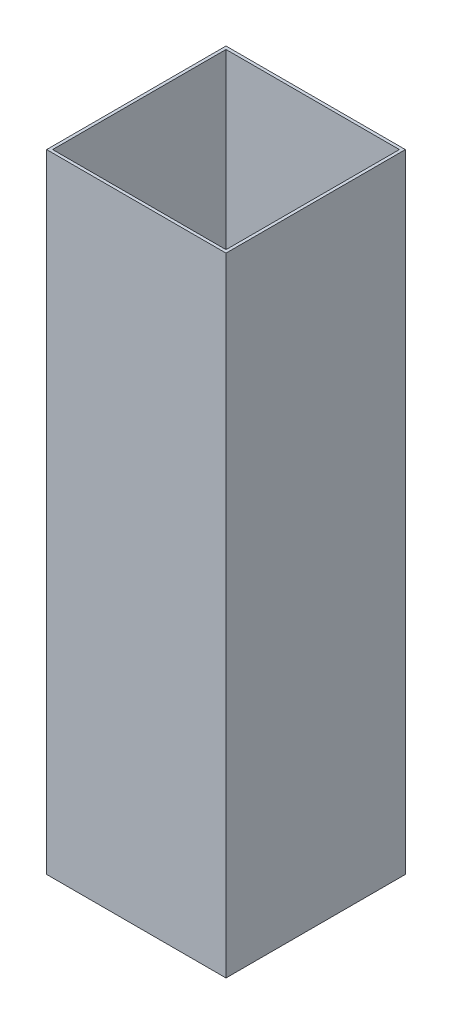
ISO-10303-21;
HEADER;
FILE_DESCRIPTION(('STEP AP214'),'2;1');
FILE_NAME('part.step','',(''),(''),'','','');
FILE_SCHEMA(('AUTOMOTIVE_DESIGN { 1 0 10303 214 1 1 1 1 }'));
ENDSEC;
DATA;
#1=APPLICATION_CONTEXT('core data for automotive mechanical design processes');
#2=APPLICATION_PROTOCOL_DEFINITION('international standard','automotive_design',2000,#1);
#3=PRODUCT_CONTEXT('',#1,'mechanical');
#4=PRODUCT('Part','Part','',(#3));
#5=PRODUCT_RELATED_PRODUCT_CATEGORY('part','',(#4));
#6=PRODUCT_DEFINITION_FORMATION('','',#4);
#7=PRODUCT_DEFINITION_CONTEXT('part definition',#1,'design');
#8=PRODUCT_DEFINITION('design','',#6,#7);
#9=PRODUCT_DEFINITION_SHAPE('','',#8);
#10=(LENGTH_UNIT() NAMED_UNIT(*) SI_UNIT(.MILLI.,.METRE.));
#11=(NAMED_UNIT(*) PLANE_ANGLE_UNIT() SI_UNIT($,.RADIAN.));
#12=(NAMED_UNIT(*) SI_UNIT($,.STERADIAN.) SOLID_ANGLE_UNIT());
#13=UNCERTAINTY_MEASURE_WITH_UNIT(LENGTH_MEASURE(1.E-05),#10,'distance_accuracy_value','');
#14=(GEOMETRIC_REPRESENTATION_CONTEXT(3) GLOBAL_UNCERTAINTY_ASSIGNED_CONTEXT((#13)) GLOBAL_UNIT_ASSIGNED_CONTEXT((#10,
#11,#12)) REPRESENTATION_CONTEXT('',''));
#15=CARTESIAN_POINT('',(0.,0.,0.));
#16=DIRECTION('',(0.,0.,1.));
#17=DIRECTION('',(1.,0.,0.));
#18=AXIS2_PLACEMENT_3D('',#15,#16,#17);
#19=CARTESIAN_POINT('',(0.,2100.,-600.));
#20=DIRECTION('',(0.,-1.,0.));
#21=DIRECTION('',(0.,0.,-1.));
#22=AXIS2_PLACEMENT_3D('',#19,#20,#21);
#23=PLANE('',#22);
#24=DIRECTION('',(0.,0.,1.));
#25=VECTOR('',#24,1.);
#26=CARTESIAN_POINT('',(0.,2100.,0.));
#27=LINE('',#26,#25);
#28=CARTESIAN_POINT('',(0.,2100.,-600.));
#29=VERTEX_POINT('',#28);
#30=CARTESIAN_POINT('',(0.,2100.,0.));
#31=VERTEX_POINT('',#30);
#32=EDGE_CURVE('E139',#29,#31,#27,.T.);
#33=ORIENTED_EDGE('',*,*,#32,.T.);
#34=DIRECTION('',(1.,0.,0.));
#35=VECTOR('',#34,1.);
#36=CARTESIAN_POINT('',(0.,2100.,0.));
#37=LINE('',#36,#35);
#38=CARTESIAN_POINT('',(600.,2100.,0.));
#39=VERTEX_POINT('',#38);
#40=EDGE_CURVE('E142',#31,#39,#37,.T.);
#41=ORIENTED_EDGE('',*,*,#40,.T.);
#42=DIRECTION('',(0.,0.,-1.));
#43=VECTOR('',#42,1.);
#44=CARTESIAN_POINT('',(600.,2100.,0.));
#45=LINE('',#44,#43);
#46=CARTESIAN_POINT('',(600.,2100.,-600.));
#47=VERTEX_POINT('',#46);
#48=EDGE_CURVE('E144',#39,#47,#45,.T.);
#49=ORIENTED_EDGE('',*,*,#48,.T.);
#50=DIRECTION('',(-1.,0.,0.));
#51=VECTOR('',#50,1.);
#52=CARTESIAN_POINT('',(0.,2100.,-600.));
#53=LINE('',#52,#51);
#54=EDGE_CURVE('E146',#47,#29,#53,.T.);
#55=ORIENTED_EDGE('',*,*,#54,.T.);
#56=EDGE_LOOP('',(#33,#41,#49,#55));
#57=FACE_BOUND('',#56,.T.);
#58=DIRECTION('',(0.,0.,1.));
#59=VECTOR('',#58,1.);
#60=CARTESIAN_POINT('',(10.,2100.,-10.));
#61=LINE('',#60,#59);
#62=CARTESIAN_POINT('',(10.,2100.,-590.));
#63=VERTEX_POINT('',#62);
#64=CARTESIAN_POINT('',(10.,2100.,-10.));
#65=VERTEX_POINT('',#64);
#66=EDGE_CURVE('E110',#63,#65,#61,.T.);
#67=ORIENTED_EDGE('',*,*,#66,.F.);
#68=DIRECTION('',(-1.,0.,0.));
#69=VECTOR('',#68,1.);
#70=CARTESIAN_POINT('',(10.,2100.,-590.));
#71=LINE('',#70,#69);
#72=CARTESIAN_POINT('',(590.,2100.,-590.));
#73=VERTEX_POINT('',#72);
#74=EDGE_CURVE('E125',#73,#63,#71,.T.);
#75=ORIENTED_EDGE('',*,*,#74,.F.);
#76=DIRECTION('',(0.,0.,-1.));
#77=VECTOR('',#76,1.);
#78=CARTESIAN_POINT('',(590.,2100.,-10.));
#79=LINE('',#78,#77);
#80=CARTESIAN_POINT('',(590.,2100.,-10.));
#81=VERTEX_POINT('',#80);
#82=EDGE_CURVE('E123',#81,#73,#79,.T.);
#83=ORIENTED_EDGE('',*,*,#82,.F.);
#84=DIRECTION('',(1.,0.,0.));
#85=VECTOR('',#84,1.);
#86=CARTESIAN_POINT('',(10.,2100.,-10.));
#87=LINE('',#86,#85);
#88=EDGE_CURVE('E121',#65,#81,#87,.T.);
#89=ORIENTED_EDGE('',*,*,#88,.F.);
#90=EDGE_LOOP('',(#67,#75,#83,#89));
#91=FACE_BOUND('',#90,.T.);
#92=ADVANCED_FACE('F30',(#57,#91),#23,.F.);
#93=CARTESIAN_POINT('',(0.,0.,-600.));
#94=DIRECTION('',(0.,-1.,0.));
#95=DIRECTION('',(0.,0.,-1.));
#96=AXIS2_PLACEMENT_3D('',#93,#94,#95);
#97=PLANE('',#96);
#98=DIRECTION('',(0.,0.,1.));
#99=VECTOR('',#98,1.);
#100=CARTESIAN_POINT('',(0.,0.,0.));
#101=LINE('',#100,#99);
#102=CARTESIAN_POINT('',(0.,0.,-600.));
#103=VERTEX_POINT('',#102);
#104=CARTESIAN_POINT('',(0.,0.,0.));
#105=VERTEX_POINT('',#104);
#106=EDGE_CURVE('E111',#103,#105,#101,.T.);
#107=ORIENTED_EDGE('',*,*,#106,.F.);
#108=DIRECTION('',(-1.,0.,0.));
#109=VECTOR('',#108,1.);
#110=CARTESIAN_POINT('',(0.,0.,-600.));
#111=LINE('',#110,#109);
#112=CARTESIAN_POINT('',(600.,0.,-600.));
#113=VERTEX_POINT('',#112);
#114=EDGE_CURVE('E137',#113,#103,#111,.T.);
#115=ORIENTED_EDGE('',*,*,#114,.F.);
#116=DIRECTION('',(0.,0.,-1.));
#117=VECTOR('',#116,1.);
#118=CARTESIAN_POINT('',(600.,0.,0.));
#119=LINE('',#118,#117);
#120=CARTESIAN_POINT('',(600.,0.,0.));
#121=VERTEX_POINT('',#120);
#122=EDGE_CURVE('E135',#121,#113,#119,.T.);
#123=ORIENTED_EDGE('',*,*,#122,.F.);
#124=DIRECTION('',(1.,0.,0.));
#125=VECTOR('',#124,1.);
#126=CARTESIAN_POINT('',(0.,0.,0.));
#127=LINE('',#126,#125);
#128=EDGE_CURVE('E133',#105,#121,#127,.T.);
#129=ORIENTED_EDGE('',*,*,#128,.F.);
#130=EDGE_LOOP('',(#107,#115,#123,#129));
#131=FACE_BOUND('',#130,.T.);
#132=DIRECTION('',(-1.,0.,0.));
#133=VECTOR('',#132,1.);
#134=CARTESIAN_POINT('',(10.,0.,-590.));
#135=LINE('',#134,#133);
#136=CARTESIAN_POINT('',(590.,0.,-590.));
#137=VERTEX_POINT('',#136);
#138=CARTESIAN_POINT('',(10.,0.,-590.));
#139=VERTEX_POINT('',#138);
#140=EDGE_CURVE('E115',#137,#139,#135,.T.);
#141=ORIENTED_EDGE('',*,*,#140,.T.);
#142=DIRECTION('',(0.,0.,1.));
#143=VECTOR('',#142,1.);
#144=CARTESIAN_POINT('',(10.,0.,-10.));
#145=LINE('',#144,#143);
#146=CARTESIAN_POINT('',(10.,0.,-10.));
#147=VERTEX_POINT('',#146);
#148=EDGE_CURVE('E53',#139,#147,#145,.T.);
#149=ORIENTED_EDGE('',*,*,#148,.T.);
#150=DIRECTION('',(1.,0.,0.));
#151=VECTOR('',#150,1.);
#152=CARTESIAN_POINT('',(10.,0.,-10.));
#153=LINE('',#152,#151);
#154=CARTESIAN_POINT('',(590.,0.,-10.));
#155=VERTEX_POINT('',#154);
#156=EDGE_CURVE('E97',#147,#155,#153,.T.);
#157=ORIENTED_EDGE('',*,*,#156,.T.);
#158=DIRECTION('',(0.,0.,-1.));
#159=VECTOR('',#158,1.);
#160=CARTESIAN_POINT('',(590.,0.,-10.));
#161=LINE('',#160,#159);
#162=EDGE_CURVE('E106',#155,#137,#161,.T.);
#163=ORIENTED_EDGE('',*,*,#162,.T.);
#164=EDGE_LOOP('',(#141,#149,#157,#163));
#165=FACE_BOUND('',#164,.T.);
#166=ADVANCED_FACE('F114',(#131,#165),#97,.T.);
#167=CARTESIAN_POINT('',(0.,2100.,0.));
#168=DIRECTION('',(1.,0.,0.));
#169=DIRECTION('',(0.,0.,-1.));
#170=AXIS2_PLACEMENT_3D('',#167,#168,#169);
#171=PLANE('',#170);
#172=ORIENTED_EDGE('',*,*,#106,.T.);
#173=DIRECTION('',(0.,-1.,0.));
#174=VECTOR('',#173,1.);
#175=CARTESIAN_POINT('',(0.,2100.,0.));
#176=LINE('',#175,#174);
#177=EDGE_CURVE('E11',#31,#105,#176,.T.);
#178=ORIENTED_EDGE('',*,*,#177,.F.);
#179=ORIENTED_EDGE('',*,*,#32,.F.);
#180=DIRECTION('',(0.,-1.,0.));
#181=VECTOR('',#180,1.);
#182=CARTESIAN_POINT('',(0.,2100.,-600.));
#183=LINE('',#182,#181);
#184=EDGE_CURVE('E148',#29,#103,#183,.T.);
#185=ORIENTED_EDGE('',*,*,#184,.T.);
#186=EDGE_LOOP('',(#172,#178,#179,#185));
#187=FACE_BOUND('',#186,.T.);
#188=ADVANCED_FACE('F32',(#187),#171,.F.);
#189=CARTESIAN_POINT('',(0.,2100.,0.));
#190=DIRECTION('',(0.,0.,-1.));
#191=DIRECTION('',(-1.,0.,0.));
#192=AXIS2_PLACEMENT_3D('',#189,#190,#191);
#193=PLANE('',#192);
#194=ORIENTED_EDGE('',*,*,#128,.T.);
#195=DIRECTION('',(0.,-1.,0.));
#196=VECTOR('',#195,1.);
#197=CARTESIAN_POINT('',(600.,2100.,0.));
#198=LINE('',#197,#196);
#199=EDGE_CURVE('E38',#39,#121,#198,.T.);
#200=ORIENTED_EDGE('',*,*,#199,.F.);
#201=ORIENTED_EDGE('',*,*,#40,.F.);
#202=ORIENTED_EDGE('',*,*,#177,.T.);
#203=EDGE_LOOP('',(#194,#200,#201,#202));
#204=FACE_BOUND('',#203,.T.);
#205=ADVANCED_FACE('F173',(#204),#193,.F.);
#206=CARTESIAN_POINT('',(600.,2100.,0.));
#207=DIRECTION('',(-1.,0.,0.));
#208=DIRECTION('',(0.,0.,1.));
#209=AXIS2_PLACEMENT_3D('',#206,#207,#208);
#210=PLANE('',#209);
#211=ORIENTED_EDGE('',*,*,#122,.T.);
#212=DIRECTION('',(0.,-1.,0.));
#213=VECTOR('',#212,1.);
#214=CARTESIAN_POINT('',(600.,2100.,-600.));
#215=LINE('',#214,#213);
#216=EDGE_CURVE('E151',#47,#113,#215,.T.);
#217=ORIENTED_EDGE('',*,*,#216,.F.);
#218=ORIENTED_EDGE('',*,*,#48,.F.);
#219=ORIENTED_EDGE('',*,*,#199,.T.);
#220=EDGE_LOOP('',(#211,#217,#218,#219));
#221=FACE_BOUND('',#220,.T.);
#222=ADVANCED_FACE('F158',(#221),#210,.F.);
#223=CARTESIAN_POINT('',(0.,2100.,-600.));
#224=DIRECTION('',(0.,0.,1.));
#225=DIRECTION('',(1.,0.,0.));
#226=AXIS2_PLACEMENT_3D('',#223,#224,#225);
#227=PLANE('',#226);
#228=ORIENTED_EDGE('',*,*,#114,.T.);
#229=ORIENTED_EDGE('',*,*,#184,.F.);
#230=ORIENTED_EDGE('',*,*,#54,.F.);
#231=ORIENTED_EDGE('',*,*,#216,.T.);
#232=EDGE_LOOP('',(#228,#229,#230,#231));
#233=FACE_BOUND('',#232,.T.);
#234=ADVANCED_FACE('F166',(#233),#227,.F.);
#235=CARTESIAN_POINT('',(10.,2100.,-10.));
#236=DIRECTION('',(1.,0.,0.));
#237=DIRECTION('',(0.,0.,-1.));
#238=AXIS2_PLACEMENT_3D('',#235,#236,#237);
#239=PLANE('',#238);
#240=ORIENTED_EDGE('',*,*,#148,.F.);
#241=DIRECTION('',(0.,-1.,0.));
#242=VECTOR('',#241,1.);
#243=CARTESIAN_POINT('',(10.,2100.,-590.));
#244=LINE('',#243,#242);
#245=EDGE_CURVE('E127',#63,#139,#244,.T.);
#246=ORIENTED_EDGE('',*,*,#245,.F.);
#247=ORIENTED_EDGE('',*,*,#66,.T.);
#248=DIRECTION('',(0.,-1.,0.));
#249=VECTOR('',#248,1.);
#250=CARTESIAN_POINT('',(10.,2100.,-10.));
#251=LINE('',#250,#249);
#252=EDGE_CURVE('E99',#65,#147,#251,.T.);
#253=ORIENTED_EDGE('',*,*,#252,.T.);
#254=EDGE_LOOP('',(#240,#246,#247,#253));
#255=FACE_BOUND('',#254,.T.);
#256=ADVANCED_FACE('F108',(#255),#239,.T.);
#257=CARTESIAN_POINT('',(10.,2100.,-10.));
#258=DIRECTION('',(0.,0.,-1.));
#259=DIRECTION('',(-1.,0.,0.));
#260=AXIS2_PLACEMENT_3D('',#257,#258,#259);
#261=PLANE('',#260);
#262=ORIENTED_EDGE('',*,*,#156,.F.);
#263=ORIENTED_EDGE('',*,*,#252,.F.);
#264=ORIENTED_EDGE('',*,*,#88,.T.);
#265=DIRECTION('',(0.,-1.,0.));
#266=VECTOR('',#265,1.);
#267=CARTESIAN_POINT('',(590.,2100.,-10.));
#268=LINE('',#267,#266);
#269=EDGE_CURVE('E102',#81,#155,#268,.T.);
#270=ORIENTED_EDGE('',*,*,#269,.T.);
#271=EDGE_LOOP('',(#262,#263,#264,#270));
#272=FACE_BOUND('',#271,.T.);
#273=ADVANCED_FACE('F98',(#272),#261,.T.);
#274=CARTESIAN_POINT('',(590.,2100.,-10.));
#275=DIRECTION('',(-1.,0.,0.));
#276=DIRECTION('',(0.,0.,1.));
#277=AXIS2_PLACEMENT_3D('',#274,#275,#276);
#278=PLANE('',#277);
#279=ORIENTED_EDGE('',*,*,#162,.F.);
#280=ORIENTED_EDGE('',*,*,#269,.F.);
#281=ORIENTED_EDGE('',*,*,#82,.T.);
#282=DIRECTION('',(0.,-1.,0.));
#283=VECTOR('',#282,1.);
#284=CARTESIAN_POINT('',(590.,2100.,-590.));
#285=LINE('',#284,#283);
#286=EDGE_CURVE('E45',#73,#137,#285,.T.);
#287=ORIENTED_EDGE('',*,*,#286,.T.);
#288=EDGE_LOOP('',(#279,#280,#281,#287));
#289=FACE_BOUND('',#288,.T.);
#290=ADVANCED_FACE('F195',(#289),#278,.T.);
#291=CARTESIAN_POINT('',(10.,2100.,-590.));
#292=DIRECTION('',(0.,0.,1.));
#293=DIRECTION('',(1.,0.,0.));
#294=AXIS2_PLACEMENT_3D('',#291,#292,#293);
#295=PLANE('',#294);
#296=ORIENTED_EDGE('',*,*,#140,.F.);
#297=ORIENTED_EDGE('',*,*,#286,.F.);
#298=ORIENTED_EDGE('',*,*,#74,.T.);
#299=ORIENTED_EDGE('',*,*,#245,.T.);
#300=EDGE_LOOP('',(#296,#297,#298,#299));
#301=FACE_BOUND('',#300,.T.);
#302=ADVANCED_FACE('F200',(#301),#295,.T.);
#303=CLOSED_SHELL('',(#92,#166,#188,#205,#222,#234,#256,#273,#290,#302));
#304=MANIFOLD_SOLID_BREP('B2',#303);
#305=ADVANCED_BREP_SHAPE_REPRESENTATION('',(#18,#304),#14);
#306=SHAPE_DEFINITION_REPRESENTATION(#9,#305);
ENDSEC;
END-ISO-10303-21;
